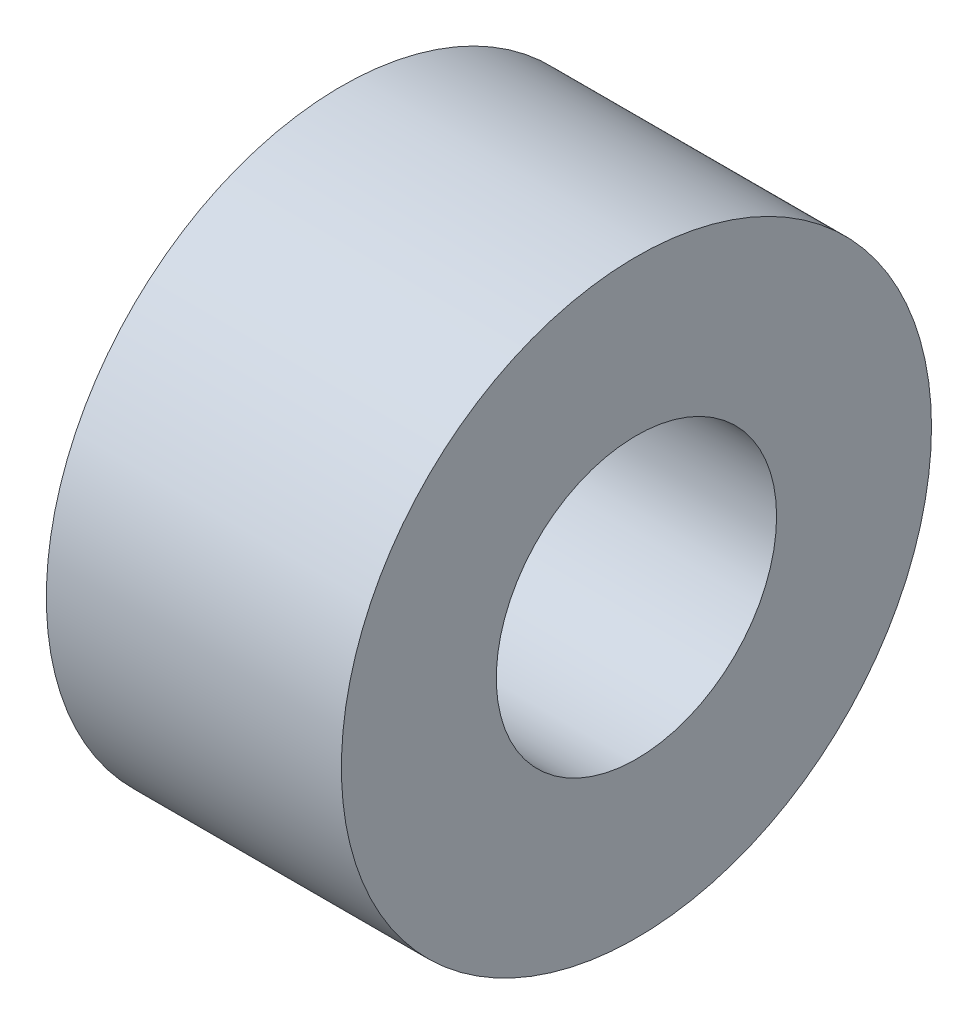
ISO-10303-21;
HEADER;
FILE_DESCRIPTION(('STEP AP214'),'2;1');
FILE_NAME('part.step','',(''),(''),'','','');
FILE_SCHEMA(('AUTOMOTIVE_DESIGN { 1 0 10303 214 1 1 1 1 }'));
ENDSEC;
DATA;
#1=APPLICATION_CONTEXT('core data for automotive mechanical design processes');
#2=APPLICATION_PROTOCOL_DEFINITION('international standard','automotive_design',2000,#1);
#3=PRODUCT_CONTEXT('',#1,'mechanical');
#4=PRODUCT('Part','Part','',(#3));
#5=PRODUCT_RELATED_PRODUCT_CATEGORY('part','',(#4));
#6=PRODUCT_DEFINITION_FORMATION('','',#4);
#7=PRODUCT_DEFINITION_CONTEXT('part definition',#1,'design');
#8=PRODUCT_DEFINITION('design','',#6,#7);
#9=PRODUCT_DEFINITION_SHAPE('','',#8);
#10=(LENGTH_UNIT() NAMED_UNIT(*) SI_UNIT(.MILLI.,.METRE.));
#11=(NAMED_UNIT(*) PLANE_ANGLE_UNIT() SI_UNIT($,.RADIAN.));
#12=(NAMED_UNIT(*) SI_UNIT($,.STERADIAN.) SOLID_ANGLE_UNIT());
#13=UNCERTAINTY_MEASURE_WITH_UNIT(LENGTH_MEASURE(1.E-05),#10,'distance_accuracy_value','');
#14=(GEOMETRIC_REPRESENTATION_CONTEXT(3) GLOBAL_UNCERTAINTY_ASSIGNED_CONTEXT((#13)) GLOBAL_UNIT_ASSIGNED_CONTEXT((#10,
#11,#12)) REPRESENTATION_CONTEXT('',''));
#15=CARTESIAN_POINT('',(0.,0.,0.));
#16=DIRECTION('',(0.,0.,1.));
#17=DIRECTION('',(1.,0.,0.));
#18=AXIS2_PLACEMENT_3D('',#15,#16,#17);
#19=CARTESIAN_POINT('',(10.,0.,0.));
#20=DIRECTION('',(1.,0.,0.));
#21=DIRECTION('',(0.,0.,-1.));
#22=AXIS2_PLACEMENT_3D('',#19,#20,#21);
#23=PLANE('',#22);
#24=CARTESIAN_POINT('',(10.,0.,0.));
#25=DIRECTION('',(1.,0.,0.));
#26=DIRECTION('',(0.,0.,-1.));
#27=AXIS2_PLACEMENT_3D('',#24,#25,#26);
#28=CIRCLE('',#27,10.);
#29=CARTESIAN_POINT('',(10.,0.,-10.));
#30=VERTEX_POINT('',#29);
#31=EDGE_CURVE('E10',#30,#30,#28,.T.);
#32=ORIENTED_EDGE('',*,*,#31,.T.);
#33=EDGE_LOOP('',(#32));
#34=FACE_BOUND('',#33,.T.);
#35=CARTESIAN_POINT('',(10.,0.,0.));
#36=DIRECTION('',(1.,0.,0.));
#37=DIRECTION('',(0.,0.,-1.));
#38=AXIS2_PLACEMENT_3D('',#35,#36,#37);
#39=CIRCLE('',#38,4.75);
#40=CARTESIAN_POINT('',(10.,0.,-4.75));
#41=VERTEX_POINT('',#40);
#42=EDGE_CURVE('E42',#41,#41,#39,.T.);
#43=ORIENTED_EDGE('',*,*,#42,.F.);
#44=EDGE_LOOP('',(#43));
#45=FACE_BOUND('',#44,.T.);
#46=ADVANCED_FACE('F31',(#34,#45),#23,.T.);
#47=CARTESIAN_POINT('',(0.,0.,0.));
#48=DIRECTION('',(1.,0.,0.));
#49=DIRECTION('',(0.,0.,-1.));
#50=AXIS2_PLACEMENT_3D('',#47,#48,#49);
#51=PLANE('',#50);
#52=CARTESIAN_POINT('',(0.,0.,0.));
#53=DIRECTION('',(1.,0.,0.));
#54=DIRECTION('',(0.,0.,-1.));
#55=AXIS2_PLACEMENT_3D('',#52,#53,#54);
#56=CIRCLE('',#55,10.);
#57=CARTESIAN_POINT('',(0.,0.,-10.));
#58=VERTEX_POINT('',#57);
#59=EDGE_CURVE('E35',#58,#58,#56,.T.);
#60=ORIENTED_EDGE('',*,*,#59,.F.);
#61=EDGE_LOOP('',(#60));
#62=FACE_BOUND('',#61,.T.);
#63=CARTESIAN_POINT('',(0.,0.,0.));
#64=DIRECTION('',(1.,0.,0.));
#65=DIRECTION('',(0.,0.,-1.));
#66=AXIS2_PLACEMENT_3D('',#63,#64,#65);
#67=CIRCLE('',#66,4.75);
#68=CARTESIAN_POINT('',(0.,0.,-4.75));
#69=VERTEX_POINT('',#68);
#70=EDGE_CURVE('E44',#69,#69,#67,.T.);
#71=ORIENTED_EDGE('',*,*,#70,.T.);
#72=EDGE_LOOP('',(#71));
#73=FACE_BOUND('',#72,.T.);
#74=ADVANCED_FACE('F54',(#62,#73),#51,.F.);
#75=CARTESIAN_POINT('',(10.,0.,0.));
#76=DIRECTION('',(-1.,0.,0.));
#77=DIRECTION('',(0.,0.,1.));
#78=AXIS2_PLACEMENT_3D('',#75,#76,#77);
#79=CYLINDRICAL_SURFACE('',#78,10.);
#80=ORIENTED_EDGE('',*,*,#31,.F.);
#81=EDGE_LOOP('',(#80));
#82=FACE_BOUND('',#81,.T.);
#83=ORIENTED_EDGE('',*,*,#59,.T.);
#84=EDGE_LOOP('',(#83));
#85=FACE_BOUND('',#84,.T.);
#86=ADVANCED_FACE('F33',(#82,#85),#79,.T.);
#87=CARTESIAN_POINT('',(10.,0.,0.));
#88=DIRECTION('',(-1.,0.,0.));
#89=DIRECTION('',(0.,0.,1.));
#90=AXIS2_PLACEMENT_3D('',#87,#88,#89);
#91=CYLINDRICAL_SURFACE('',#90,4.75);
#92=ORIENTED_EDGE('',*,*,#42,.T.);
#93=EDGE_LOOP('',(#92));
#94=FACE_BOUND('',#93,.T.);
#95=ORIENTED_EDGE('',*,*,#70,.F.);
#96=EDGE_LOOP('',(#95));
#97=FACE_BOUND('',#96,.T.);
#98=ADVANCED_FACE('F50',(#94,#97),#91,.F.);
#99=CLOSED_SHELL('',(#46,#74,#86,#98));
#100=MANIFOLD_SOLID_BREP('B2',#99);
#101=ADVANCED_BREP_SHAPE_REPRESENTATION('',(#18,#100),#14);
#102=SHAPE_DEFINITION_REPRESENTATION(#9,#101);
ENDSEC;
END-ISO-10303-21;
